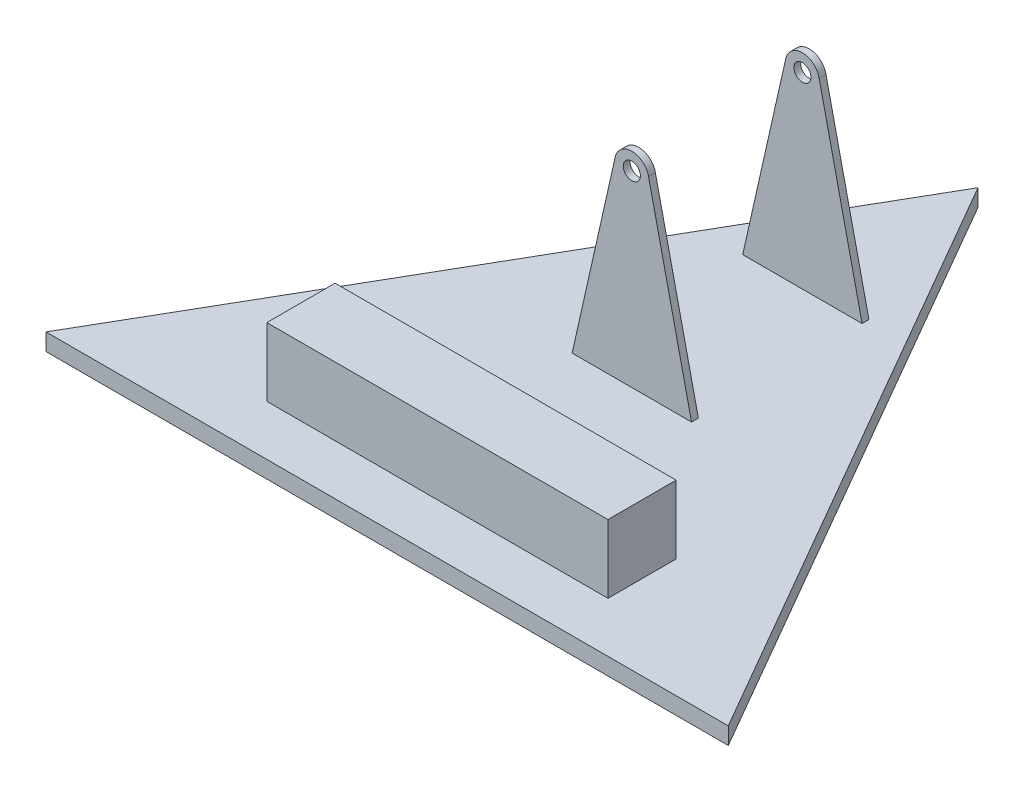
ISO-10303-21;
HEADER;
FILE_DESCRIPTION(('STEP AP214'),'2;1');
FILE_NAME('part.step','',(''),(''),'','','');
FILE_SCHEMA(('AUTOMOTIVE_DESIGN { 1 0 10303 214 1 1 1 1 }'));
ENDSEC;
DATA;
#1=APPLICATION_CONTEXT('core data for automotive mechanical design processes');
#2=APPLICATION_PROTOCOL_DEFINITION('international standard','automotive_design',2000,#1);
#3=PRODUCT_CONTEXT('',#1,'mechanical');
#4=PRODUCT('Part','Part','',(#3));
#5=PRODUCT_RELATED_PRODUCT_CATEGORY('part','',(#4));
#6=PRODUCT_DEFINITION_FORMATION('','',#4);
#7=PRODUCT_DEFINITION_CONTEXT('part definition',#1,'design');
#8=PRODUCT_DEFINITION('design','',#6,#7);
#9=PRODUCT_DEFINITION_SHAPE('','',#8);
#10=(LENGTH_UNIT() NAMED_UNIT(*) SI_UNIT(.MILLI.,.METRE.));
#11=(NAMED_UNIT(*) PLANE_ANGLE_UNIT() SI_UNIT($,.RADIAN.));
#12=(NAMED_UNIT(*) SI_UNIT($,.STERADIAN.) SOLID_ANGLE_UNIT());
#13=UNCERTAINTY_MEASURE_WITH_UNIT(LENGTH_MEASURE(1.E-05),#10,'distance_accuracy_value','');
#14=(GEOMETRIC_REPRESENTATION_CONTEXT(3) GLOBAL_UNCERTAINTY_ASSIGNED_CONTEXT((#13)) GLOBAL_UNIT_ASSIGNED_CONTEXT((#10,
#11,#12)) REPRESENTATION_CONTEXT('',''));
#15=CARTESIAN_POINT('',(0.,0.,0.));
#16=DIRECTION('',(0.,0.,1.));
#17=DIRECTION('',(1.,0.,0.));
#18=AXIS2_PLACEMENT_3D('',#15,#16,#17);
#19=CARTESIAN_POINT('',(0.,5.,0.));
#20=DIRECTION('',(0.,1.,0.));
#21=DIRECTION('',(0.,0.,1.));
#22=AXIS2_PLACEMENT_3D('',#19,#20,#21);
#23=PLANE('',#22);
#24=DIRECTION('',(0.,0.,-1.));
#25=VECTOR('',#24,1.);
#26=CARTESIAN_POINT('',(17.5,5.,-64.));
#27=LINE('',#26,#25);
#28=CARTESIAN_POINT('',(17.5,5.,-64.));
#29=VERTEX_POINT('',#28);
#30=CARTESIAN_POINT('',(17.5,5.,-66.));
#31=VERTEX_POINT('',#30);
#32=EDGE_CURVE('E263',#29,#31,#27,.T.);
#33=ORIENTED_EDGE('',*,*,#32,.F.);
#34=DIRECTION('',(1.,0.,0.));
#35=VECTOR('',#34,1.);
#36=CARTESIAN_POINT('',(-17.5,5.,-64.));
#37=LINE('',#36,#35);
#38=CARTESIAN_POINT('',(-17.5,5.,-64.));
#39=VERTEX_POINT('',#38);
#40=EDGE_CURVE('E270',#39,#29,#37,.T.);
#41=ORIENTED_EDGE('',*,*,#40,.F.);
#42=DIRECTION('',(0.,0.,1.));
#43=VECTOR('',#42,1.);
#44=CARTESIAN_POINT('',(-17.5,5.,-64.));
#45=LINE('',#44,#43);
#46=CARTESIAN_POINT('',(-17.5,5.,-66.));
#47=VERTEX_POINT('',#46);
#48=EDGE_CURVE('E268',#47,#39,#45,.T.);
#49=ORIENTED_EDGE('',*,*,#48,.F.);
#50=DIRECTION('',(-1.,0.,0.));
#51=VECTOR('',#50,1.);
#52=CARTESIAN_POINT('',(-17.5,5.,-66.));
#53=LINE('',#52,#51);
#54=EDGE_CURVE('E265',#31,#47,#53,.T.);
#55=ORIENTED_EDGE('',*,*,#54,.F.);
#56=EDGE_LOOP('',(#33,#41,#49,#55));
#57=FACE_BOUND('',#56,.T.);
#58=DIRECTION('',(0.,0.,1.));
#59=VECTOR('',#58,1.);
#60=CARTESIAN_POINT('',(-17.5,5.,-14.));
#61=LINE('',#60,#59);
#62=CARTESIAN_POINT('',(-17.5,5.,-16.));
#63=VERTEX_POINT('',#62);
#64=CARTESIAN_POINT('',(-17.5,5.,-14.));
#65=VERTEX_POINT('',#64);
#66=EDGE_CURVE('E258',#63,#65,#61,.T.);
#67=ORIENTED_EDGE('',*,*,#66,.F.);
#68=DIRECTION('',(-1.,0.,0.));
#69=VECTOR('',#68,1.);
#70=CARTESIAN_POINT('',(-17.5,5.,-16.));
#71=LINE('',#70,#69);
#72=CARTESIAN_POINT('',(17.5,5.,-16.));
#73=VERTEX_POINT('',#72);
#74=EDGE_CURVE('E255',#73,#63,#71,.T.);
#75=ORIENTED_EDGE('',*,*,#74,.F.);
#76=DIRECTION('',(0.,0.,-1.));
#77=VECTOR('',#76,1.);
#78=CARTESIAN_POINT('',(17.5,5.,-14.));
#79=LINE('',#78,#77);
#80=CARTESIAN_POINT('',(17.5,5.,-14.));
#81=VERTEX_POINT('',#80);
#82=EDGE_CURVE('E253',#81,#73,#79,.T.);
#83=ORIENTED_EDGE('',*,*,#82,.F.);
#84=DIRECTION('',(1.,0.,0.));
#85=VECTOR('',#84,1.);
#86=CARTESIAN_POINT('',(-17.5,5.,-14.));
#87=LINE('',#86,#85);
#88=EDGE_CURVE('E260',#65,#81,#87,.T.);
#89=ORIENTED_EDGE('',*,*,#88,.F.);
#90=EDGE_LOOP('',(#67,#75,#83,#89));
#91=FACE_BOUND('',#90,.T.);
#92=DIRECTION('',(-0.5,0.,-0.866025403784438));
#93=VECTOR('',#92,1.);
#94=CARTESIAN_POINT('',(100.,5.,57.7350269189626));
#95=LINE('',#94,#93);
#96=CARTESIAN_POINT('',(100.,5.,57.7350269189626));
#97=VERTEX_POINT('',#96);
#98=CARTESIAN_POINT('',(0.,5.,-115.470053837925));
#99=VERTEX_POINT('',#98);
#100=EDGE_CURVE('E274',#97,#99,#95,.T.);
#101=ORIENTED_EDGE('',*,*,#100,.T.);
#102=DIRECTION('',(-0.5,0.,0.866025403784439));
#103=VECTOR('',#102,1.);
#104=CARTESIAN_POINT('',(0.,5.,-115.470053837925));
#105=LINE('',#104,#103);
#106=CARTESIAN_POINT('',(-100.,5.,57.7350269189626));
#107=VERTEX_POINT('',#106);
#108=EDGE_CURVE('E103',#99,#107,#105,.T.);
#109=ORIENTED_EDGE('',*,*,#108,.T.);
#110=DIRECTION('',(1.,0.,0.));
#111=VECTOR('',#110,1.);
#112=CARTESIAN_POINT('',(-100.,5.,57.7350269189626));
#113=LINE('',#112,#111);
#114=EDGE_CURVE('E81',#107,#97,#113,.T.);
#115=ORIENTED_EDGE('',*,*,#114,.T.);
#116=EDGE_LOOP('',(#101,#109,#115));
#117=FACE_BOUND('',#116,.T.);
#118=DIRECTION('',(-1.,0.,0.));
#119=VECTOR('',#118,1.);
#120=CARTESIAN_POINT('',(-50.,5.,23.));
#121=LINE('',#120,#119);
#122=CARTESIAN_POINT('',(50.,5.,23.));
#123=VERTEX_POINT('',#122);
#124=CARTESIAN_POINT('',(-50.,5.,23.));
#125=VERTEX_POINT('',#124);
#126=EDGE_CURVE('E297',#123,#125,#121,.T.);
#127=ORIENTED_EDGE('',*,*,#126,.F.);
#128=DIRECTION('',(0.,0.,-1.));
#129=VECTOR('',#128,1.);
#130=CARTESIAN_POINT('',(50.,5.,43.));
#131=LINE('',#130,#129);
#132=CARTESIAN_POINT('',(50.,5.,43.));
#133=VERTEX_POINT('',#132);
#134=EDGE_CURVE('E196',#133,#123,#131,.T.);
#135=ORIENTED_EDGE('',*,*,#134,.F.);
#136=DIRECTION('',(1.,0.,0.));
#137=VECTOR('',#136,1.);
#138=CARTESIAN_POINT('',(-50.,5.,43.));
#139=LINE('',#138,#137);
#140=CARTESIAN_POINT('',(-50.,5.,43.));
#141=VERTEX_POINT('',#140);
#142=EDGE_CURVE('E192',#141,#133,#139,.T.);
#143=ORIENTED_EDGE('',*,*,#142,.F.);
#144=DIRECTION('',(0.,0.,1.));
#145=VECTOR('',#144,1.);
#146=CARTESIAN_POINT('',(-50.,5.,43.));
#147=LINE('',#146,#145);
#148=EDGE_CURVE('E299',#125,#141,#147,.T.);
#149=ORIENTED_EDGE('',*,*,#148,.F.);
#150=EDGE_LOOP('',(#127,#135,#143,#149));
#151=FACE_BOUND('',#150,.T.);
#152=ADVANCED_FACE('F57',(#57,#91,#117,#151),#23,.T.);
#153=CARTESIAN_POINT('',(-17.5,65.,-66.));
#154=DIRECTION('',(0.,0.,1.));
#155=DIRECTION('',(1.,0.,0.));
#156=AXIS2_PLACEMENT_3D('',#153,#154,#155);
#157=PLANE('',#156);
#158=CARTESIAN_POINT('',(0.,60.,-66.));
#159=DIRECTION('',(0.,0.,1.));
#160=DIRECTION('',(1.,0.,0.));
#161=AXIS2_PLACEMENT_3D('',#158,#159,#160);
#162=CIRCLE('',#161,2.5);
#163=CARTESIAN_POINT('',(2.5,60.,-66.));
#164=VERTEX_POINT('',#163);
#165=EDGE_CURVE('E211',#164,#164,#162,.T.);
#166=ORIENTED_EDGE('',*,*,#165,.T.);
#167=EDGE_LOOP('',(#166));
#168=FACE_BOUND('',#167,.T.);
#169=CARTESIAN_POINT('',(0.,60.,-66.));
#170=DIRECTION('',(0.,0.,1.));
#171=DIRECTION('',(1.,0.,0.));
#172=AXIS2_PLACEMENT_3D('',#169,#170,#171);
#173=CIRCLE('',#172,5.);
#174=CARTESIAN_POINT('',(4.89859076833673,61.0019024325583,-66.));
#175=VERTEX_POINT('',#174);
#176=CARTESIAN_POINT('',(-4.89859076833673,61.0019024325583,-66.));
#177=VERTEX_POINT('',#176);
#178=EDGE_CURVE('E242',#175,#177,#173,.T.);
#179=ORIENTED_EDGE('',*,*,#178,.F.);
#180=DIRECTION('',(-0.219528464606205,0.975606095321079,0.));
#181=VECTOR('',#180,1.);
#182=CARTESIAN_POINT('',(2.96285537299001,69.6045009794787,-66.));
#183=LINE('',#182,#181);
#184=EDGE_CURVE('E226',#31,#175,#183,.T.);
#185=ORIENTED_EDGE('',*,*,#184,.F.);
#186=ORIENTED_EDGE('',*,*,#54,.T.);
#187=DIRECTION('',(0.219528464606205,0.975606095321079,0.));
#188=VECTOR('',#187,1.);
#189=CARTESIAN_POINT('',(-4.64960151002253,62.1084351936585,-66.));
#190=LINE('',#189,#188);
#191=EDGE_CURVE('E250',#47,#177,#190,.T.);
#192=ORIENTED_EDGE('',*,*,#191,.T.);
#193=EDGE_LOOP('',(#179,#185,#186,#192));
#194=FACE_BOUND('',#193,.T.);
#195=ADVANCED_FACE('F293',(#168,#194),#157,.F.);
#196=CARTESIAN_POINT('',(-17.5,65.,-64.));
#197=DIRECTION('',(0.,0.,-1.));
#198=DIRECTION('',(-1.,0.,0.));
#199=AXIS2_PLACEMENT_3D('',#196,#197,#198);
#200=PLANE('',#199);
#201=CARTESIAN_POINT('',(0.,60.,-64.));
#202=DIRECTION('',(0.,0.,-1.));
#203=DIRECTION('',(-1.,0.,0.));
#204=AXIS2_PLACEMENT_3D('',#201,#202,#203);
#205=CIRCLE('',#204,2.5);
#206=CARTESIAN_POINT('',(-2.5,60.,-64.));
#207=VERTEX_POINT('',#206);
#208=EDGE_CURVE('E208',#207,#207,#205,.T.);
#209=ORIENTED_EDGE('',*,*,#208,.T.);
#210=EDGE_LOOP('',(#209));
#211=FACE_BOUND('',#210,.T.);
#212=DIRECTION('',(0.219528464606205,-0.975606095321079,0.));
#213=VECTOR('',#212,1.);
#214=CARTESIAN_POINT('',(2.96285537299001,69.6045009794787,-64.));
#215=LINE('',#214,#213);
#216=CARTESIAN_POINT('',(4.89859076833673,61.0019024325583,-64.));
#217=VERTEX_POINT('',#216);
#218=EDGE_CURVE('E224',#217,#29,#215,.T.);
#219=ORIENTED_EDGE('',*,*,#218,.F.);
#220=CARTESIAN_POINT('',(0.,60.,-64.));
#221=DIRECTION('',(0.,0.,-1.));
#222=DIRECTION('',(-1.,0.,0.));
#223=AXIS2_PLACEMENT_3D('',#220,#221,#222);
#224=CIRCLE('',#223,5.);
#225=CARTESIAN_POINT('',(-4.89859076833673,61.0019024325583,-64.));
#226=VERTEX_POINT('',#225);
#227=EDGE_CURVE('E240',#226,#217,#224,.T.);
#228=ORIENTED_EDGE('',*,*,#227,.F.);
#229=DIRECTION('',(-0.219528464606205,-0.975606095321079,0.));
#230=VECTOR('',#229,1.);
#231=CARTESIAN_POINT('',(-4.64960151002253,62.1084351936585,-64.));
#232=LINE('',#231,#230);
#233=EDGE_CURVE('E247',#226,#39,#232,.T.);
#234=ORIENTED_EDGE('',*,*,#233,.T.);
#235=ORIENTED_EDGE('',*,*,#40,.T.);
#236=EDGE_LOOP('',(#219,#228,#234,#235));
#237=FACE_BOUND('',#236,.T.);
#238=ADVANCED_FACE('F351',(#211,#237),#200,.F.);
#239=CARTESIAN_POINT('',(-17.5,65.,-16.));
#240=DIRECTION('',(0.,0.,1.));
#241=DIRECTION('',(1.,0.,0.));
#242=AXIS2_PLACEMENT_3D('',#239,#240,#241);
#243=PLANE('',#242);
#244=CARTESIAN_POINT('',(0.,60.,-16.));
#245=DIRECTION('',(0.,0.,1.));
#246=DIRECTION('',(1.,0.,0.));
#247=AXIS2_PLACEMENT_3D('',#244,#245,#246);
#248=CIRCLE('',#247,2.5);
#249=CARTESIAN_POINT('',(2.5,60.,-16.));
#250=VERTEX_POINT('',#249);
#251=EDGE_CURVE('E201',#250,#250,#248,.T.);
#252=ORIENTED_EDGE('',*,*,#251,.T.);
#253=EDGE_LOOP('',(#252));
#254=FACE_BOUND('',#253,.T.);
#255=CARTESIAN_POINT('',(0.,60.,-16.));
#256=DIRECTION('',(0.,0.,1.));
#257=DIRECTION('',(1.,0.,0.));
#258=AXIS2_PLACEMENT_3D('',#255,#256,#257);
#259=CIRCLE('',#258,5.);
#260=CARTESIAN_POINT('',(4.89859076833673,61.0019024325583,-16.));
#261=VERTEX_POINT('',#260);
#262=CARTESIAN_POINT('',(-4.89859076833673,61.0019024325583,-16.));
#263=VERTEX_POINT('',#262);
#264=EDGE_CURVE('E238',#261,#263,#259,.T.);
#265=ORIENTED_EDGE('',*,*,#264,.F.);
#266=DIRECTION('',(-0.219528464606205,0.975606095321079,0.));
#267=VECTOR('',#266,1.);
#268=CARTESIAN_POINT('',(2.96285537299001,69.6045009794787,-16.));
#269=LINE('',#268,#267);
#270=EDGE_CURVE('E221',#73,#261,#269,.T.);
#271=ORIENTED_EDGE('',*,*,#270,.F.);
#272=ORIENTED_EDGE('',*,*,#74,.T.);
#273=DIRECTION('',(0.219528464606205,0.975606095321079,0.));
#274=VECTOR('',#273,1.);
#275=CARTESIAN_POINT('',(-4.64960151002253,62.1084351936585,-16.));
#276=LINE('',#275,#274);
#277=EDGE_CURVE('E244',#63,#263,#276,.T.);
#278=ORIENTED_EDGE('',*,*,#277,.T.);
#279=EDGE_LOOP('',(#265,#271,#272,#278));
#280=FACE_BOUND('',#279,.T.);
#281=ADVANCED_FACE('F347',(#254,#280),#243,.F.);
#282=CARTESIAN_POINT('',(-17.5,65.,-14.));
#283=DIRECTION('',(0.,0.,-1.));
#284=DIRECTION('',(-1.,0.,0.));
#285=AXIS2_PLACEMENT_3D('',#282,#283,#284);
#286=PLANE('',#285);
#287=CARTESIAN_POINT('',(0.,60.,-14.));
#288=DIRECTION('',(0.,0.,1.));
#289=DIRECTION('',(1.,0.,0.));
#290=AXIS2_PLACEMENT_3D('',#287,#288,#289);
#291=CIRCLE('',#290,2.5);
#292=CARTESIAN_POINT('',(2.5,60.,-14.));
#293=VERTEX_POINT('',#292);
#294=EDGE_CURVE('E198',#293,#293,#291,.T.);
#295=ORIENTED_EDGE('',*,*,#294,.F.);
#296=EDGE_LOOP('',(#295));
#297=FACE_BOUND('',#296,.T.);
#298=DIRECTION('',(-0.219528464606205,0.975606095321079,0.));
#299=VECTOR('',#298,1.);
#300=CARTESIAN_POINT('',(17.7274934723152,3.98899662677189,-14.));
#301=LINE('',#300,#299);
#302=CARTESIAN_POINT('',(4.89859076833673,61.0019024325583,-14.));
#303=VERTEX_POINT('',#302);
#304=EDGE_CURVE('E218',#81,#303,#301,.T.);
#305=ORIENTED_EDGE('',*,*,#304,.T.);
#306=CARTESIAN_POINT('',(0.,60.,-14.));
#307=DIRECTION('',(0.,0.,1.));
#308=DIRECTION('',(1.,0.,0.));
#309=AXIS2_PLACEMENT_3D('',#306,#307,#308);
#310=CIRCLE('',#309,5.);
#311=CARTESIAN_POINT('',(-4.89859076833673,61.0019024325583,-14.));
#312=VERTEX_POINT('',#311);
#313=EDGE_CURVE('E229',#303,#312,#310,.T.);
#314=ORIENTED_EDGE('',*,*,#313,.T.);
#315=DIRECTION('',(0.219528464606205,0.975606095321079,0.));
#316=VECTOR('',#315,1.);
#317=CARTESIAN_POINT('',(-17.7274934723152,3.98899662677189,-14.));
#318=LINE('',#317,#316);
#319=EDGE_CURVE('E232',#65,#312,#318,.T.);
#320=ORIENTED_EDGE('',*,*,#319,.F.);
#321=ORIENTED_EDGE('',*,*,#88,.T.);
#322=EDGE_LOOP('',(#305,#314,#320,#321));
#323=FACE_BOUND('',#322,.T.);
#324=ADVANCED_FACE('F344',(#297,#323),#286,.F.);
#325=CARTESIAN_POINT('',(100.,5.,57.7350269189626));
#326=DIRECTION('',(-0.866025403784439,0.,0.5));
#327=DIRECTION('',(0.5,0.,0.866025403784439));
#328=AXIS2_PLACEMENT_3D('',#325,#326,#327);
#329=PLANE('',#328);
#330=DIRECTION('',(-0.5,0.,-0.866025403784438));
#331=VECTOR('',#330,1.);
#332=CARTESIAN_POINT('',(100.,0.,57.7350269189626));
#333=LINE('',#332,#331);
#334=CARTESIAN_POINT('',(100.,0.,57.7350269189626));
#335=VERTEX_POINT('',#334);
#336=CARTESIAN_POINT('',(0.,0.,-115.470053837925));
#337=VERTEX_POINT('',#336);
#338=EDGE_CURVE('E273',#335,#337,#333,.T.);
#339=ORIENTED_EDGE('',*,*,#338,.T.);
#340=DIRECTION('',(0.,-1.,0.));
#341=VECTOR('',#340,1.);
#342=CARTESIAN_POINT('',(0.,5.,-115.470053837925));
#343=LINE('',#342,#341);
#344=EDGE_CURVE('E12',#99,#337,#343,.T.);
#345=ORIENTED_EDGE('',*,*,#344,.F.);
#346=ORIENTED_EDGE('',*,*,#100,.F.);
#347=DIRECTION('',(0.,-1.,0.));
#348=VECTOR('',#347,1.);
#349=CARTESIAN_POINT('',(100.,5.,57.7350269189626));
#350=LINE('',#349,#348);
#351=EDGE_CURVE('E278',#97,#335,#350,.T.);
#352=ORIENTED_EDGE('',*,*,#351,.T.);
#353=EDGE_LOOP('',(#339,#345,#346,#352));
#354=FACE_BOUND('',#353,.T.);
#355=ADVANCED_FACE('F59',(#354),#329,.F.);
#356=CARTESIAN_POINT('',(0.,5.,-115.470053837925));
#357=DIRECTION('',(0.866025403784439,0.,0.5));
#358=DIRECTION('',(0.5,0.,-0.866025403784439));
#359=AXIS2_PLACEMENT_3D('',#356,#357,#358);
#360=PLANE('',#359);
#361=DIRECTION('',(-0.5,0.,0.866025403784439));
#362=VECTOR('',#361,1.);
#363=CARTESIAN_POINT('',(0.,0.,-115.470053837925));
#364=LINE('',#363,#362);
#365=CARTESIAN_POINT('',(-100.,0.,57.7350269189626));
#366=VERTEX_POINT('',#365);
#367=EDGE_CURVE('E281',#337,#366,#364,.T.);
#368=ORIENTED_EDGE('',*,*,#367,.T.);
#369=DIRECTION('',(0.,-1.,0.));
#370=VECTOR('',#369,1.);
#371=CARTESIAN_POINT('',(-100.,5.,57.7350269189626));
#372=LINE('',#371,#370);
#373=EDGE_CURVE('E65',#107,#366,#372,.T.);
#374=ORIENTED_EDGE('',*,*,#373,.F.);
#375=ORIENTED_EDGE('',*,*,#108,.F.);
#376=ORIENTED_EDGE('',*,*,#344,.T.);
#377=EDGE_LOOP('',(#368,#374,#375,#376));
#378=FACE_BOUND('',#377,.T.);
#379=ADVANCED_FACE('F362',(#378),#360,.F.);
#380=CARTESIAN_POINT('',(-100.,5.,57.7350269189626));
#381=DIRECTION('',(0.,0.,-1.));
#382=DIRECTION('',(-1.,0.,0.));
#383=AXIS2_PLACEMENT_3D('',#380,#381,#382);
#384=PLANE('',#383);
#385=DIRECTION('',(1.,0.,0.));
#386=VECTOR('',#385,1.);
#387=CARTESIAN_POINT('',(-100.,0.,57.7350269189626));
#388=LINE('',#387,#386);
#389=EDGE_CURVE('E98',#366,#335,#388,.T.);
#390=ORIENTED_EDGE('',*,*,#389,.T.);
#391=ORIENTED_EDGE('',*,*,#351,.F.);
#392=ORIENTED_EDGE('',*,*,#114,.F.);
#393=ORIENTED_EDGE('',*,*,#373,.T.);
#394=EDGE_LOOP('',(#390,#391,#392,#393));
#395=FACE_BOUND('',#394,.T.);
#396=ADVANCED_FACE('F284',(#395),#384,.F.);
#397=CARTESIAN_POINT('',(0.,0.,0.));
#398=DIRECTION('',(0.,1.,0.));
#399=DIRECTION('',(0.,0.,1.));
#400=AXIS2_PLACEMENT_3D('',#397,#398,#399);
#401=PLANE('',#400);
#402=ORIENTED_EDGE('',*,*,#338,.F.);
#403=ORIENTED_EDGE('',*,*,#389,.F.);
#404=ORIENTED_EDGE('',*,*,#367,.F.);
#405=EDGE_LOOP('',(#402,#403,#404));
#406=FACE_BOUND('',#405,.T.);
#407=ADVANCED_FACE('F287',(#406),#401,.F.);
#408=CARTESIAN_POINT('',(0.,60.,-74.));
#409=DIRECTION('',(0.,0.,1.));
#410=DIRECTION('',(1.,0.,0.));
#411=AXIS2_PLACEMENT_3D('',#408,#409,#410);
#412=CYLINDRICAL_SURFACE('',#411,5.);
#413=ORIENTED_EDGE('',*,*,#264,.T.);
#414=DIRECTION('',(0.,0.,1.));
#415=VECTOR('',#414,1.);
#416=CARTESIAN_POINT('',(-4.89859076833673,61.0019024325583,-74.));
#417=LINE('',#416,#415);
#418=EDGE_CURVE('E235',#263,#312,#417,.T.);
#419=ORIENTED_EDGE('',*,*,#418,.T.);
#420=ORIENTED_EDGE('',*,*,#313,.F.);
#421=DIRECTION('',(0.,0.,1.));
#422=VECTOR('',#421,1.);
#423=CARTESIAN_POINT('',(4.89859076833673,61.0019024325583,-74.));
#424=LINE('',#423,#422);
#425=EDGE_CURVE('E214',#261,#303,#424,.T.);
#426=ORIENTED_EDGE('',*,*,#425,.F.);
#427=EDGE_LOOP('',(#413,#419,#420,#426));
#428=FACE_BOUND('',#427,.T.);
#429=ADVANCED_FACE('F343',(#428),#412,.T.);
#430=CARTESIAN_POINT('',(-17.7274934723152,3.98899662677189,-74.));
#431=DIRECTION('',(0.975606095321079,-0.219528464606205,0.));
#432=DIRECTION('',(0.219528464606205,0.975606095321079,0.));
#433=AXIS2_PLACEMENT_3D('',#430,#431,#432);
#434=PLANE('',#433);
#435=ORIENTED_EDGE('',*,*,#66,.T.);
#436=ORIENTED_EDGE('',*,*,#319,.T.);
#437=ORIENTED_EDGE('',*,*,#418,.F.);
#438=ORIENTED_EDGE('',*,*,#277,.F.);
#439=EDGE_LOOP('',(#435,#436,#437,#438));
#440=FACE_BOUND('',#439,.T.);
#441=ADVANCED_FACE('F338',(#440),#434,.F.);
#442=ORIENTED_EDGE('',*,*,#48,.T.);
#443=ORIENTED_EDGE('',*,*,#233,.F.);
#444=EDGE_CURVE('E237',#177,#226,#417,.T.);
#445=ORIENTED_EDGE('',*,*,#444,.F.);
#446=ORIENTED_EDGE('',*,*,#191,.F.);
#447=EDGE_LOOP('',(#442,#443,#445,#446));
#448=FACE_BOUND('',#447,.T.);
#449=ADVANCED_FACE('F335',(#448),#434,.F.);
#450=ORIENTED_EDGE('',*,*,#178,.T.);
#451=ORIENTED_EDGE('',*,*,#444,.T.);
#452=ORIENTED_EDGE('',*,*,#227,.T.);
#453=EDGE_CURVE('E217',#175,#217,#424,.T.);
#454=ORIENTED_EDGE('',*,*,#453,.F.);
#455=EDGE_LOOP('',(#450,#451,#452,#454));
#456=FACE_BOUND('',#455,.T.);
#457=ADVANCED_FACE('F333',(#456),#412,.T.);
#458=CARTESIAN_POINT('',(17.7274934723152,3.98899662677189,-74.));
#459=DIRECTION('',(0.975606095321079,0.219528464606205,0.));
#460=DIRECTION('',(-0.219528464606205,0.975606095321079,0.));
#461=AXIS2_PLACEMENT_3D('',#458,#459,#460);
#462=PLANE('',#461);
#463=ORIENTED_EDGE('',*,*,#184,.T.);
#464=ORIENTED_EDGE('',*,*,#453,.T.);
#465=ORIENTED_EDGE('',*,*,#218,.T.);
#466=ORIENTED_EDGE('',*,*,#32,.T.);
#467=EDGE_LOOP('',(#463,#464,#465,#466));
#468=FACE_BOUND('',#467,.T.);
#469=ADVANCED_FACE('F329',(#468),#462,.T.);
#470=ORIENTED_EDGE('',*,*,#270,.T.);
#471=ORIENTED_EDGE('',*,*,#425,.T.);
#472=ORIENTED_EDGE('',*,*,#304,.F.);
#473=ORIENTED_EDGE('',*,*,#82,.T.);
#474=EDGE_LOOP('',(#470,#471,#472,#473));
#475=FACE_BOUND('',#474,.T.);
#476=ADVANCED_FACE('F332',(#475),#462,.T.);
#477=CARTESIAN_POINT('',(0.,60.,-74.));
#478=DIRECTION('',(0.,0.,1.));
#479=DIRECTION('',(1.,0.,0.));
#480=AXIS2_PLACEMENT_3D('',#477,#478,#479);
#481=CYLINDRICAL_SURFACE('',#480,2.5);
#482=ORIENTED_EDGE('',*,*,#294,.T.);
#483=EDGE_LOOP('',(#482));
#484=FACE_BOUND('',#483,.T.);
#485=ORIENTED_EDGE('',*,*,#251,.F.);
#486=EDGE_LOOP('',(#485));
#487=FACE_BOUND('',#486,.T.);
#488=ADVANCED_FACE('F327',(#484,#487),#481,.F.);
#489=ORIENTED_EDGE('',*,*,#208,.F.);
#490=EDGE_LOOP('',(#489));
#491=FACE_BOUND('',#490,.T.);
#492=ORIENTED_EDGE('',*,*,#165,.F.);
#493=EDGE_LOOP('',(#492));
#494=FACE_BOUND('',#493,.T.);
#495=ADVANCED_FACE('F324',(#491,#494),#481,.F.);
#496=CARTESIAN_POINT('',(50.,25.,43.));
#497=DIRECTION('',(-1.,0.,0.));
#498=DIRECTION('',(0.,0.,1.));
#499=AXIS2_PLACEMENT_3D('',#496,#497,#498);
#500=PLANE('',#499);
#501=ORIENTED_EDGE('',*,*,#134,.T.);
#502=DIRECTION('',(0.,-1.,0.));
#503=VECTOR('',#502,1.);
#504=CARTESIAN_POINT('',(50.,25.,23.));
#505=LINE('',#504,#503);
#506=CARTESIAN_POINT('',(50.,25.,23.));
#507=VERTEX_POINT('',#506);
#508=EDGE_CURVE('E177',#507,#123,#505,.T.);
#509=ORIENTED_EDGE('',*,*,#508,.F.);
#510=DIRECTION('',(0.,0.,-1.));
#511=VECTOR('',#510,1.);
#512=CARTESIAN_POINT('',(50.,25.,43.));
#513=LINE('',#512,#511);
#514=CARTESIAN_POINT('',(50.,25.,43.));
#515=VERTEX_POINT('',#514);
#516=EDGE_CURVE('E184',#515,#507,#513,.T.);
#517=ORIENTED_EDGE('',*,*,#516,.F.);
#518=DIRECTION('',(0.,-1.,0.));
#519=VECTOR('',#518,1.);
#520=CARTESIAN_POINT('',(50.,25.,43.));
#521=LINE('',#520,#519);
#522=EDGE_CURVE('E306',#515,#133,#521,.T.);
#523=ORIENTED_EDGE('',*,*,#522,.T.);
#524=EDGE_LOOP('',(#501,#509,#517,#523));
#525=FACE_BOUND('',#524,.T.);
#526=ADVANCED_FACE('F194',(#525),#500,.F.);
#527=CARTESIAN_POINT('',(-50.,25.,23.));
#528=DIRECTION('',(0.,0.,1.));
#529=DIRECTION('',(1.,0.,0.));
#530=AXIS2_PLACEMENT_3D('',#527,#528,#529);
#531=PLANE('',#530);
#532=ORIENTED_EDGE('',*,*,#126,.T.);
#533=DIRECTION('',(0.,-1.,0.));
#534=VECTOR('',#533,1.);
#535=CARTESIAN_POINT('',(-50.,25.,23.));
#536=LINE('',#535,#534);
#537=CARTESIAN_POINT('',(-50.,25.,23.));
#538=VERTEX_POINT('',#537);
#539=EDGE_CURVE('E180',#538,#125,#536,.T.);
#540=ORIENTED_EDGE('',*,*,#539,.F.);
#541=DIRECTION('',(-1.,0.,0.));
#542=VECTOR('',#541,1.);
#543=CARTESIAN_POINT('',(-50.,25.,23.));
#544=LINE('',#543,#542);
#545=EDGE_CURVE('E173',#507,#538,#544,.T.);
#546=ORIENTED_EDGE('',*,*,#545,.F.);
#547=ORIENTED_EDGE('',*,*,#508,.T.);
#548=EDGE_LOOP('',(#532,#540,#546,#547));
#549=FACE_BOUND('',#548,.T.);
#550=ADVANCED_FACE('F175',(#549),#531,.F.);
#551=CARTESIAN_POINT('',(-50.,25.,43.));
#552=DIRECTION('',(1.,0.,0.));
#553=DIRECTION('',(0.,0.,-1.));
#554=AXIS2_PLACEMENT_3D('',#551,#552,#553);
#555=PLANE('',#554);
#556=ORIENTED_EDGE('',*,*,#148,.T.);
#557=DIRECTION('',(0.,-1.,0.));
#558=VECTOR('',#557,1.);
#559=CARTESIAN_POINT('',(-50.,25.,43.));
#560=LINE('',#559,#558);
#561=CARTESIAN_POINT('',(-50.,25.,43.));
#562=VERTEX_POINT('',#561);
#563=EDGE_CURVE('E72',#562,#141,#560,.T.);
#564=ORIENTED_EDGE('',*,*,#563,.F.);
#565=DIRECTION('',(0.,0.,1.));
#566=VECTOR('',#565,1.);
#567=CARTESIAN_POINT('',(-50.,25.,43.));
#568=LINE('',#567,#566);
#569=EDGE_CURVE('E183',#538,#562,#568,.T.);
#570=ORIENTED_EDGE('',*,*,#569,.F.);
#571=ORIENTED_EDGE('',*,*,#539,.T.);
#572=EDGE_LOOP('',(#556,#564,#570,#571));
#573=FACE_BOUND('',#572,.T.);
#574=ADVANCED_FACE('F309',(#573),#555,.F.);
#575=CARTESIAN_POINT('',(-50.,25.,43.));
#576=DIRECTION('',(0.,0.,-1.));
#577=DIRECTION('',(-1.,0.,0.));
#578=AXIS2_PLACEMENT_3D('',#575,#576,#577);
#579=PLANE('',#578);
#580=ORIENTED_EDGE('',*,*,#142,.T.);
#581=ORIENTED_EDGE('',*,*,#522,.F.);
#582=DIRECTION('',(1.,0.,0.));
#583=VECTOR('',#582,1.);
#584=CARTESIAN_POINT('',(-50.,25.,43.));
#585=LINE('',#584,#583);
#586=EDGE_CURVE('E188',#562,#515,#585,.T.);
#587=ORIENTED_EDGE('',*,*,#586,.F.);
#588=ORIENTED_EDGE('',*,*,#563,.T.);
#589=EDGE_LOOP('',(#580,#581,#587,#588));
#590=FACE_BOUND('',#589,.T.);
#591=ADVANCED_FACE('F310',(#590),#579,.F.);
#592=CARTESIAN_POINT('',(0.,25.,0.));
#593=DIRECTION('',(0.,-1.,0.));
#594=DIRECTION('',(0.,0.,-1.));
#595=AXIS2_PLACEMENT_3D('',#592,#593,#594);
#596=PLANE('',#595);
#597=ORIENTED_EDGE('',*,*,#516,.T.);
#598=ORIENTED_EDGE('',*,*,#545,.T.);
#599=ORIENTED_EDGE('',*,*,#569,.T.);
#600=ORIENTED_EDGE('',*,*,#586,.T.);
#601=EDGE_LOOP('',(#597,#598,#599,#600));
#602=FACE_BOUND('',#601,.T.);
#603=ADVANCED_FACE('F187',(#602),#596,.F.);
#604=CLOSED_SHELL('',(#152,#195,#238,#281,#324,#355,#379,#396,#407,#429,#441,#449,#457,#469,
#476,#488,#495,#526,#550,#574,#591,#603));
#605=MANIFOLD_SOLID_BREP('B2',#604);
#606=ADVANCED_BREP_SHAPE_REPRESENTATION('',(#18,#605),#14);
#607=SHAPE_DEFINITION_REPRESENTATION(#9,#606);
ENDSEC;
END-ISO-10303-21;
